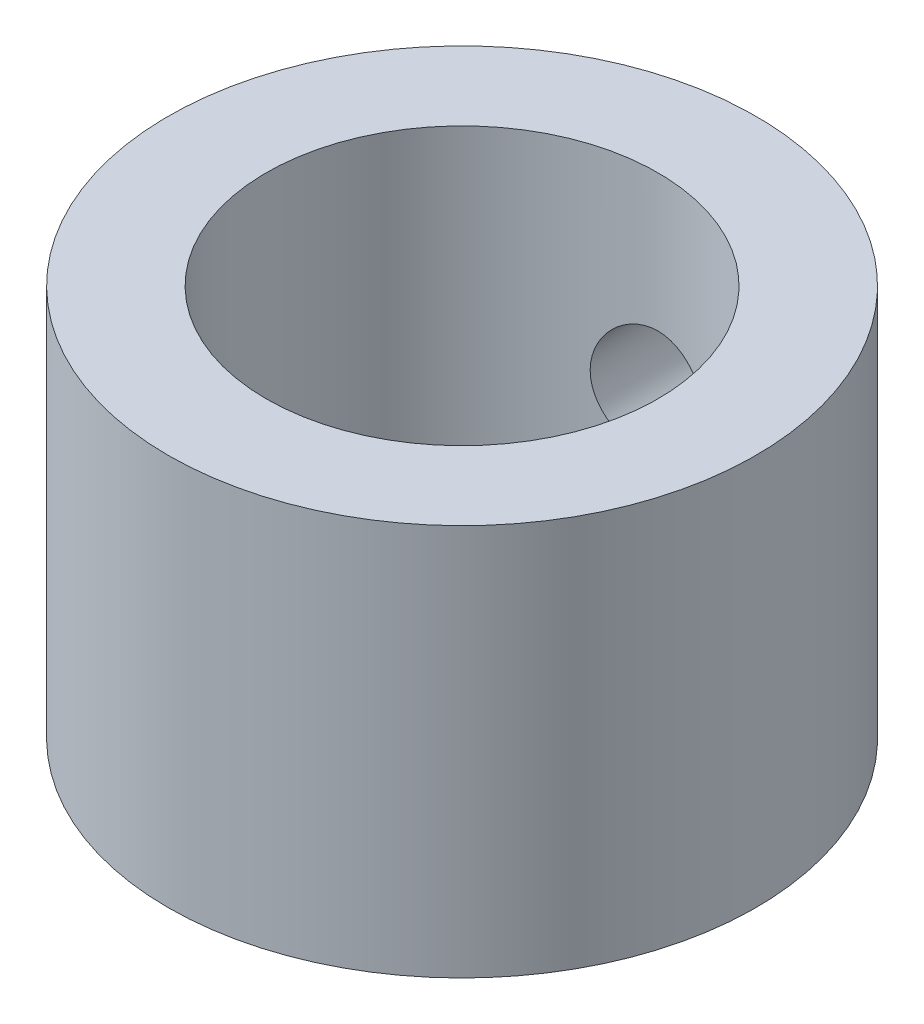
ISO-10303-21;
HEADER;
FILE_DESCRIPTION(('STEP AP214'),'2;1');
FILE_NAME('part.step','',(''),(''),'','','');
FILE_SCHEMA(('AUTOMOTIVE_DESIGN { 1 0 10303 214 1 1 1 1 }'));
ENDSEC;
DATA;
#1=APPLICATION_CONTEXT('core data for automotive mechanical design processes');
#2=APPLICATION_PROTOCOL_DEFINITION('international standard','automotive_design',2000,#1);
#3=PRODUCT_CONTEXT('',#1,'mechanical');
#4=PRODUCT('Part','Part','',(#3));
#5=PRODUCT_RELATED_PRODUCT_CATEGORY('part','',(#4));
#6=PRODUCT_DEFINITION_FORMATION('','',#4);
#7=PRODUCT_DEFINITION_CONTEXT('part definition',#1,'design');
#8=PRODUCT_DEFINITION('design','',#6,#7);
#9=PRODUCT_DEFINITION_SHAPE('','',#8);
#10=(LENGTH_UNIT() NAMED_UNIT(*) SI_UNIT(.MILLI.,.METRE.));
#11=(NAMED_UNIT(*) PLANE_ANGLE_UNIT() SI_UNIT($,.RADIAN.));
#12=(NAMED_UNIT(*) SI_UNIT($,.STERADIAN.) SOLID_ANGLE_UNIT());
#13=UNCERTAINTY_MEASURE_WITH_UNIT(LENGTH_MEASURE(1.E-05),#10,'distance_accuracy_value','');
#14=(GEOMETRIC_REPRESENTATION_CONTEXT(3) GLOBAL_UNCERTAINTY_ASSIGNED_CONTEXT((#13)) GLOBAL_UNIT_ASSIGNED_CONTEXT((#10,
#11,#12)) REPRESENTATION_CONTEXT('',''));
#15=CARTESIAN_POINT('',(0.,0.,0.));
#16=DIRECTION('',(0.,0.,1.));
#17=DIRECTION('',(1.,0.,0.));
#18=AXIS2_PLACEMENT_3D('',#15,#16,#17);
#19=CARTESIAN_POINT('',(0.,5.,0.));
#20=DIRECTION('',(0.,1.,0.));
#21=DIRECTION('',(0.,0.,1.));
#22=AXIS2_PLACEMENT_3D('',#19,#20,#21);
#23=PLANE('',#22);
#24=CARTESIAN_POINT('',(0.,5.,0.));
#25=DIRECTION('',(0.,1.,0.));
#26=DIRECTION('',(0.,0.,1.));
#27=AXIS2_PLACEMENT_3D('',#24,#25,#26);
#28=CIRCLE('',#27,7.5);
#29=CARTESIAN_POINT('',(0.,5.,7.5));
#30=VERTEX_POINT('',#29);
#31=EDGE_CURVE('E10',#30,#30,#28,.T.);
#32=ORIENTED_EDGE('',*,*,#31,.T.);
#33=EDGE_LOOP('',(#32));
#34=FACE_BOUND('',#33,.T.);
#35=CARTESIAN_POINT('',(0.,5.,0.));
#36=DIRECTION('',(0.,1.,0.));
#37=DIRECTION('',(0.,0.,1.));
#38=AXIS2_PLACEMENT_3D('',#35,#36,#37);
#39=CIRCLE('',#38,5.);
#40=CARTESIAN_POINT('',(0.,5.,5.));
#41=VERTEX_POINT('',#40);
#42=EDGE_CURVE('E55',#41,#41,#39,.T.);
#43=ORIENTED_EDGE('',*,*,#42,.F.);
#44=EDGE_LOOP('',(#43));
#45=FACE_BOUND('',#44,.T.);
#46=ADVANCED_FACE('F37',(#34,#45),#23,.T.);
#47=CARTESIAN_POINT('',(0.,-5.,0.));
#48=DIRECTION('',(0.,1.,0.));
#49=DIRECTION('',(0.,0.,1.));
#50=AXIS2_PLACEMENT_3D('',#47,#48,#49);
#51=PLANE('',#50);
#52=CARTESIAN_POINT('',(0.,-5.,0.));
#53=DIRECTION('',(0.,1.,0.));
#54=DIRECTION('',(0.,0.,1.));
#55=AXIS2_PLACEMENT_3D('',#52,#53,#54);
#56=CIRCLE('',#55,7.5);
#57=CARTESIAN_POINT('',(0.,-5.,7.5));
#58=VERTEX_POINT('',#57);
#59=EDGE_CURVE('E50',#58,#58,#56,.T.);
#60=ORIENTED_EDGE('',*,*,#59,.F.);
#61=EDGE_LOOP('',(#60));
#62=FACE_BOUND('',#61,.T.);
#63=CARTESIAN_POINT('',(0.,-5.,0.));
#64=DIRECTION('',(0.,1.,0.));
#65=DIRECTION('',(0.,0.,1.));
#66=AXIS2_PLACEMENT_3D('',#63,#64,#65);
#67=CIRCLE('',#66,5.);
#68=CARTESIAN_POINT('',(0.,-5.,5.));
#69=VERTEX_POINT('',#68);
#70=EDGE_CURVE('E57',#69,#69,#67,.T.);
#71=ORIENTED_EDGE('',*,*,#70,.T.);
#72=EDGE_LOOP('',(#71));
#73=FACE_BOUND('',#72,.T.);
#74=ADVANCED_FACE('F77',(#62,#73),#51,.F.);
#75=CARTESIAN_POINT('',(0.,5.,0.));
#76=DIRECTION('',(0.,-1.,0.));
#77=DIRECTION('',(0.,0.,-1.));
#78=AXIS2_PLACEMENT_3D('',#75,#76,#77);
#79=CYLINDRICAL_SURFACE('',#78,7.5);
#80=CARTESIAN_POINT('',(1.5,0.,-7.34846922834953));
#81=CARTESIAN_POINT('',(1.49999691881235,-0.0833465632357616,-7.34847088538349));
#82=CARTESIAN_POINT('',(1.49302975757707,-0.16673193499975,-7.34990262402618));
#83=CARTESIAN_POINT('',(1.46536842537441,-0.331143757714958,-7.35546646957746));
#84=CARTESIAN_POINT('',(1.44466327060578,-0.41216826695404,-7.35960073717297));
#85=CARTESIAN_POINT('',(1.39019367392958,-0.569455955031247,-7.37008310582665));
#86=CARTESIAN_POINT('',(1.35644222122892,-0.645723782298866,-7.37642900431582));
#87=CARTESIAN_POINT('',(1.27687366150577,-0.791512267045452,-7.39061699221019));
#88=CARTESIAN_POINT('',(1.23105722790173,-0.861033300806858,-7.398458998102));
#89=CARTESIAN_POINT('',(1.12796861348015,-0.992341505780786,-7.4148794954137));
#90=CARTESIAN_POINT('',(1.07055848386998,-1.05401938182596,-7.42346606755867));
#91=CARTESIAN_POINT('',(0.946210183531966,-1.16693630036847,-7.440337084539));
#92=CARTESIAN_POINT('',(0.879271345466976,-1.21817461112579,-7.44862150816248));
#93=CARTESIAN_POINT('',(0.737042033886383,-1.30918202644269,-7.46404194626342));
#94=CARTESIAN_POINT('',(0.661683851508316,-1.34884727072496,-7.47116732162326));
#95=CARTESIAN_POINT('',(0.505206225580907,-1.41491240557221,-7.48337605325447));
#96=CARTESIAN_POINT('',(0.424087322130829,-1.44131353785149,-7.48845960066179));
#97=CARTESIAN_POINT('',(0.259525159917741,-1.47976079042944,-7.49595481032628));
#98=CARTESIAN_POINT('',(0.176126608822221,-1.49199146635651,-7.4984007943219));
#99=CARTESIAN_POINT('',(0.00842785265630416,-1.50232642775747,-7.50046381775405));
#100=CARTESIAN_POINT('',(-0.0758722647477651,-1.50043207446873,-7.50008112979138));
#101=CARTESIAN_POINT('',(-0.241713001115383,-1.48271072967667,-7.49655652302773));
#102=CARTESIAN_POINT('',(-0.323275821447706,-1.46708253424823,-7.49345397548757));
#103=CARTESIAN_POINT('',(-0.482597439870452,-1.42265245131166,-7.48488265739113));
#104=CARTESIAN_POINT('',(-0.560356085620694,-1.39385003671219,-7.47941379216059));
#105=CARTESIAN_POINT('',(-0.710429194801331,-1.3237049397791,-7.46665944029938));
#106=CARTESIAN_POINT('',(-0.78270626120085,-1.28228437334267,-7.45936272262835));
#107=CARTESIAN_POINT('',(-0.919357568789634,-1.1881363841451,-7.44375704210678));
#108=CARTESIAN_POINT('',(-0.983730899287502,-1.13540766034423,-7.43544796282833));
#109=CARTESIAN_POINT('',(-1.10392714658019,-1.01904956683729,-7.41856446546689));
#110=CARTESIAN_POINT('',(-1.15958147486045,-0.955246219905615,-7.40998794686274));
#111=CARTESIAN_POINT('',(-1.25942773976521,-0.819125336323872,-7.39367357398141));
#112=CARTESIAN_POINT('',(-1.30361945959163,-0.746807638675206,-7.38593573556822));
#113=CARTESIAN_POINT('',(-1.37934422220282,-0.595468752267292,-7.37217071209385));
#114=CARTESIAN_POINT('',(-1.41084997166656,-0.516433548540507,-7.36614722345324));
#115=CARTESIAN_POINT('',(-1.46008551244137,-0.354043014414013,-7.35654714481909));
#116=CARTESIAN_POINT('',(-1.47781709918496,-0.270688248571374,-7.35297023592642));
#117=CARTESIAN_POINT('',(-1.49874900905408,-0.103552713001432,-7.34873218901742));
#118=CARTESIAN_POINT('',(-1.50219278834687,-0.0198036385344886,-7.34802220585731));
#119=CARTESIAN_POINT('',(-1.49510644246611,0.147072334799526,-7.34946728533281));
#120=CARTESIAN_POINT('',(-1.48457710968366,0.230199268678295,-7.35162218550582));
#121=CARTESIAN_POINT('',(-1.45005331211124,0.392652960438353,-7.35850848742372));
#122=CARTESIAN_POINT('',(-1.42618893125895,0.472008514553645,-7.36321498521745));
#123=CARTESIAN_POINT('',(-1.36581155296278,0.625594918543112,-7.37465234027497));
#124=CARTESIAN_POINT('',(-1.32929751355977,0.699825345653581,-7.38138336429404));
#125=CARTESIAN_POINT('',(-1.2441062133234,0.842119664925242,-7.39622108943059));
#126=CARTESIAN_POINT('',(-1.19527661697413,0.910090569451241,-7.40434457797355));
#127=CARTESIAN_POINT('',(-1.08704335831907,1.03696246800137,-7.42100585739955));
#128=CARTESIAN_POINT('',(-1.02763860771681,1.09586252737388,-7.42954369085727));
#129=CARTESIAN_POINT('',(-0.898848410246835,1.20384383877837,-7.44623018803823));
#130=CARTESIAN_POINT('',(-0.829323748394444,1.25276048197499,-7.45437086563026));
#131=CARTESIAN_POINT('',(-0.682901844952132,1.33821882224938,-7.4692069144293));
#132=CARTESIAN_POINT('',(-0.606004913150259,1.37476103901717,-7.47590234632816));
#133=CARTESIAN_POINT('',(-0.447454021236018,1.43419330761995,-7.487059410916));
#134=CARTESIAN_POINT('',(-0.365830010217116,1.45716077733938,-7.49153368713906));
#135=CARTESIAN_POINT('',(-0.199784182019868,1.48903687149577,-7.4977985390649));
#136=CARTESIAN_POINT('',(-0.11536270306682,1.49794718921352,-7.49958943799765));
#137=CARTESIAN_POINT('',(0.052309340855436,1.50139047144433,-7.50027810681181));
#138=CARTESIAN_POINT('',(0.135554718212254,1.49617092068432,-7.49922567824026));
#139=CARTESIAN_POINT('',(0.299956546973463,1.47204907417828,-7.49445065340477));
#140=CARTESIAN_POINT('',(0.381113024630538,1.45314695047789,-7.49072809071528));
#141=CARTESIAN_POINT('',(0.538879124617645,1.40230651186253,-7.481032475475));
#142=CARTESIAN_POINT('',(0.615498664860422,1.37039793280322,-7.47506455871866));
#143=CARTESIAN_POINT('',(0.762331830278929,1.29448163800365,-7.46152083185077));
#144=CARTESIAN_POINT('',(0.832544948651118,1.25047296614443,-7.45394489468828));
#145=CARTESIAN_POINT('',(0.965795835159536,1.15077091940688,-7.43786398736791));
#146=CARTESIAN_POINT('',(1.02869957417475,1.09490049541984,-7.4293460013317));
#147=CARTESIAN_POINT('',(1.14432392663527,0.973424639856348,-7.41241834355477));
#148=CARTESIAN_POINT('',(1.19704212480408,0.90781690579693,-7.40400869794476));
#149=CARTESIAN_POINT('',(1.29133832918279,0.767881024949694,-7.3881501412478));
#150=CARTESIAN_POINT('',(1.33279022195961,0.693466558259308,-7.38071255446371));
#151=CARTESIAN_POINT('',(1.40253607393175,0.538600840050601,-7.36777855777287));
#152=CARTESIAN_POINT('',(1.43084196896908,0.458155141953655,-7.36228038807748));
#153=CARTESIAN_POINT('',(1.4680037097813,0.314606316844753,-7.3549452169166));
#154=CARTESIAN_POINT('',(1.47998084778413,0.252321870731514,-7.35253177367824));
#155=CARTESIAN_POINT('',(1.49598002694097,0.126699068170847,-7.34929317692711));
#156=CARTESIAN_POINT('',(1.50000234234439,0.0633607481325584,-7.34846796865859));
#157=CARTESIAN_POINT('',(1.5,0.,-7.34846922834953));
#158=B_SPLINE_CURVE_WITH_KNOTS('',3,(#80,#81,#82,#83,#84,#85,#86,#87,#88,#89,#90,#91,#92,#93,
#94,#95,#96,#97,#98,#99,#100,#101,#102,#103,#104,#105,#106,#107,#108,#109,#110,#111,#112,#113,
#114,#115,#116,#117,#118,#119,#120,#121,#122,#123,#124,#125,#126,#127,#128,#129,#130,#131,#132,
#133,#134,#135,#136,#137,#138,#139,#140,#141,#142,#143,#144,#145,#146,#147,#148,#149,#150,#151,
#152,#153,#154,#155,#156,#157),.UNSPECIFIED.,.T.,.F.,(4,2,2,2,2,2,2,2,2,2,2,2,2,2,2,2,2,2,2,2,2,
2,2,2,2,2,2,2,2,2,2,2,2,2,2,2,2,2,4),(0.,0.249807695804142,0.499815358926445,0.749574746910879,
0.999320197289796,1.25223378822655,1.50516510053133,1.76030100656175,2.0154130236984,
2.26716373324621,2.51889018174372,2.76703184450306,3.01518343610625,3.26489886333455,
3.51464303655099,3.76874020143725,4.02284217184081,4.27748794759165,4.53210052524037,
4.7823563670689,5.03259801792632,5.28044012674978,5.52830265531598,5.77939589661782,
6.03051499305313,6.28548902600176,6.54045234945157,6.79394720367975,7.04741152037442,
7.29646526122029,7.54551587050135,7.79400025613178,8.04250428202026,8.29501728038395,
8.54759008334672,8.80288347868562,9.05794462633399,9.24785705455344,9.43776293526322),.UNSPECIFIED.);
#159=CARTESIAN_POINT('',(1.5,0.,-7.34846922834953));
#160=VERTEX_POINT('',#159);
#161=EDGE_CURVE('E62',#160,#160,#158,.T.);
#162=ORIENTED_EDGE('',*,*,#161,.F.);
#163=EDGE_LOOP('',(#162));
#164=FACE_BOUND('',#163,.T.);
#165=ORIENTED_EDGE('',*,*,#31,.F.);
#166=EDGE_LOOP('',(#165));
#167=FACE_BOUND('',#166,.T.);
#168=ORIENTED_EDGE('',*,*,#59,.T.);
#169=EDGE_LOOP('',(#168));
#170=FACE_BOUND('',#169,.T.);
#171=ADVANCED_FACE('F39',(#164,#167,#170),#79,.T.);
#172=CARTESIAN_POINT('',(0.,5.,0.));
#173=DIRECTION('',(0.,-1.,0.));
#174=DIRECTION('',(0.,0.,-1.));
#175=AXIS2_PLACEMENT_3D('',#172,#173,#174);
#176=CYLINDRICAL_SURFACE('',#175,5.);
#177=CARTESIAN_POINT('',(0.,1.5,-5.));
#178=CARTESIAN_POINT('',(-0.0822886127532999,1.49999900251511,-4.9999992925055));
#179=CARTESIAN_POINT('',(-0.164587318351529,1.49320613637603,-4.99794915693953));
#180=CARTESIAN_POINT('',(-0.326788125304881,1.4662786457779,-4.98997105593691));
#181=CARTESIAN_POINT('',(-0.40668950441142,1.44614004197666,-4.98404193389692));
#182=CARTESIAN_POINT('',(-0.561732707754526,1.39325398308974,-4.96895552501836));
#183=CARTESIAN_POINT('',(-0.636881364395373,1.36052513038106,-4.95980300250425));
#184=CARTESIAN_POINT('',(-0.780624181053131,1.28346390694416,-4.93922109237645));
#185=CARTESIAN_POINT('',(-0.849217467469669,1.23912999260458,-4.92779140192067));
#186=CARTESIAN_POINT('',(-0.979871797183745,1.13877599252733,-4.90350737192774));
#187=CARTESIAN_POINT('',(-1.04171807124434,1.08248337411409,-4.89062383657036));
#188=CARTESIAN_POINT('',(-1.15524920923324,0.960390770089816,-4.86505834210442));
#189=CARTESIAN_POINT('',(-1.20693236327441,0.89458918787504,-4.85237641724501));
#190=CARTESIAN_POINT('',(-1.29980037723708,0.753529246962388,-4.82834113993772));
#191=CARTESIAN_POINT('',(-1.34072309022213,0.678091539009262,-4.81702406663875));
#192=CARTESIAN_POINT('',(-1.4092139477476,0.521010745769707,-4.79743620394031));
#193=CARTESIAN_POINT('',(-1.43678529919973,0.439369156072024,-4.78916468313311));
#194=CARTESIAN_POINT('',(-1.47701633682652,0.27460973386954,-4.77690870838434));
#195=CARTESIAN_POINT('',(-1.49007196234677,0.191597256136057,-4.77281069324533));
#196=CARTESIAN_POINT('',(-1.50213730614672,0.0244668437832343,-4.76902789749767));
#197=CARTESIAN_POINT('',(-1.50115042761078,-0.0596508180590877,-4.76934204760571));
#198=CARTESIAN_POINT('',(-1.48546977199812,-0.223383908608484,-4.77424744067778));
#199=CARTESIAN_POINT('',(-1.47127205262685,-0.303052250362239,-4.7786838859914));
#200=CARTESIAN_POINT('',(-1.43037420427056,-0.458819786273461,-4.79108356228624));
#201=CARTESIAN_POINT('',(-1.40367284141641,-0.534918627374333,-4.7990471413235));
#202=CARTESIAN_POINT('',(-1.33816026653682,-0.68260034966074,-4.81772733074973));
#203=CARTESIAN_POINT('',(-1.29918816934642,-0.754107083955263,-4.82848016115952));
#204=CARTESIAN_POINT('',(-1.21035222588683,-0.889732022010193,-4.85150987000064));
#205=CARTESIAN_POINT('',(-1.16048574002588,-0.953848429413778,-4.86378711746991));
#206=CARTESIAN_POINT('',(-1.04881290765546,-1.07568619076202,-4.88911011297937));
#207=CARTESIAN_POINT('',(-0.986594907466972,-1.13302866402967,-4.90216654310498));
#208=CARTESIAN_POINT('',(-0.853263259313967,-1.23655398406425,-4.92712244063258));
#209=CARTESIAN_POINT('',(-0.782149051860888,-1.28273612841443,-4.9390218351841));
#210=CARTESIAN_POINT('',(-0.632355038342803,-1.36285992246473,-4.9604316006947));
#211=CARTESIAN_POINT('',(-0.55362774974795,-1.39671751624986,-4.96992543668314));
#212=CARTESIAN_POINT('',(-0.391245415603519,-1.45059959009963,-4.98533521832222));
#213=CARTESIAN_POINT('',(-0.307591751589581,-1.47062792853249,-4.99125216186999));
#214=CARTESIAN_POINT('',(-0.140952242668331,-1.49565217789939,-4.99868364643538));
#215=CARTESIAN_POINT('',(-0.0580500976011867,-1.50116158580161,-5.0003485041779));
#216=CARTESIAN_POINT('',(0.107499605823383,-1.49843084428792,-4.99952923241759));
#217=CARTESIAN_POINT('',(0.190147196690781,-1.49019253034856,-4.99704565677756));
#218=CARTESIAN_POINT('',(0.350903605309697,-1.4606153888885,-4.98830696987163));
#219=CARTESIAN_POINT('',(0.429072772614169,-1.43957661241913,-4.98213829799417));
#220=CARTESIAN_POINT('',(0.580754638954522,-1.3853567672218,-4.96674347841532));
#221=CARTESIAN_POINT('',(0.654266777025583,-1.35217423896214,-4.95751696321085));
#222=CARTESIAN_POINT('',(0.796437189461052,-1.27374683451887,-4.93669654351325));
#223=CARTESIAN_POINT('',(0.864943826199669,-1.22824065905203,-4.92505280829675));
#224=CARTESIAN_POINT('',(0.993523307980147,-1.12677524594719,-4.90073468764317));
#225=CARTESIAN_POINT('',(1.05359403235593,-1.07081338811233,-4.8880600443108));
#226=CARTESIAN_POINT('',(1.16585744551027,-0.947612691630655,-4.86253171869138));
#227=CARTESIAN_POINT('',(1.21768481231504,-0.880038124228263,-4.84968825033268));
#228=CARTESIAN_POINT('',(1.30928995072154,-0.736872060986467,-4.82576515238463));
#229=CARTESIAN_POINT('',(1.34906803829472,-0.661280775441786,-4.81468547654651));
#230=CARTESIAN_POINT('',(1.41517347127168,-0.504467508745312,-4.79567189615055));
#231=CARTESIAN_POINT('',(1.4415634693705,-0.423273813463409,-4.78772337843827));
#232=CARTESIAN_POINT('',(1.48021730815114,-0.257312031068522,-4.77591594362794));
#233=CARTESIAN_POINT('',(1.49248598978779,-0.172545179212331,-4.772055625083));
#234=CARTESIAN_POINT('',(1.50221984485059,-0.00563848162377246,-4.76899972496087));
#235=CARTESIAN_POINT('',(1.5002805530849,0.0764636510175857,-4.76961647442754));
#236=CARTESIAN_POINT('',(1.48307505444813,0.2391141033728,-4.77499401288294));
#237=CARTESIAN_POINT('',(1.46780938124716,0.319662485176353,-4.77975463592551));
#238=CARTESIAN_POINT('',(1.42476888804136,0.475945399142852,-4.79275763670385));
#239=CARTESIAN_POINT('',(1.39715175507068,0.551727287361693,-4.80095604545965));
#240=CARTESIAN_POINT('',(1.33031507121129,0.697642438817723,-4.81990278909136));
#241=CARTESIAN_POINT('',(1.29109329962876,0.767774617640757,-4.83065161194312));
#242=CARTESIAN_POINT('',(1.20048763805072,0.903163116527113,-4.85397676425833));
#243=CARTESIAN_POINT('',(1.14871276092994,0.968148761260411,-4.86660540163797));
#244=CARTESIAN_POINT('',(1.03517434629782,1.08870249830786,-4.89201320450026));
#245=CARTESIAN_POINT('',(0.973408217134502,1.14426813946776,-4.90479240823905));
#246=CARTESIAN_POINT('',(0.839465762183249,1.24602341229503,-4.92950936570649));
#247=CARTESIAN_POINT('',(0.767037885790608,1.29189144685549,-4.94141159765674));
#248=CARTESIAN_POINT('',(0.61514137398353,1.37073516990402,-4.96260680455813));
#249=CARTESIAN_POINT('',(0.535676052998955,1.40371688827451,-4.97190099931066));
#250=CARTESIAN_POINT('',(0.380757712655281,1.45289527565275,-4.98602174969301));
#251=CARTESIAN_POINT('',(0.305786961954234,1.47051167288325,-4.99122027381067));
#252=CARTESIAN_POINT('',(0.153880195230779,1.49406352524158,-4.99820944494492));
#253=CARTESIAN_POINT('',(0.0769445098581396,1.50000093270482,-5.0000006615474));
#254=CARTESIAN_POINT('',(0.,1.5,-5.));
#255=B_SPLINE_CURVE_WITH_KNOTS('',3,(#177,#178,#179,#180,#181,#182,#183,#184,#185,#186,#187,
#188,#189,#190,#191,#192,#193,#194,#195,#196,#197,#198,#199,#200,#201,#202,#203,#204,#205,#206,
#207,#208,#209,#210,#211,#212,#213,#214,#215,#216,#217,#218,#219,#220,#221,#222,#223,#224,#225,
#226,#227,#228,#229,#230,#231,#232,#233,#234,#235,#236,#237,#238,#239,#240,#241,#242,#243,#244,
#245,#246,#247,#248,#249,#250,#251,#252,#253,#254),.UNSPECIFIED.,.T.,.F.,(4,2,2,2,2,2,2,2,2,2,2,
2,2,2,2,2,2,2,2,2,2,2,2,2,2,2,2,2,2,2,2,2,2,2,2,2,2,2,4),(0.,0.246583203612611,
0.493239964845999,0.739533676300874,0.985860164412702,1.23855602948191,1.49129437288633,
1.74971481004109,2.00807314543224,2.25919689356599,2.51025978319089,2.75226016697676,
2.99428443658001,3.2396242644712,3.48502360158555,3.74067104048167,3.99633456531072,
4.25371046881689,4.51101453528808,4.75908809438545,5.00712853550327,5.24956746682327,
5.49203554593729,5.74011305702908,5.98825282000191,6.24540400322819,6.5025484425268,
6.75847814951252,7.01432009460283,7.25950155466943,7.504673196616,7.74680040402721,
7.98897397553107,8.23996925679931,8.49102974897502,8.74942996156671,9.00770911595235,
9.23831691930459,9.46888616948874),.UNSPECIFIED.);
#256=CARTESIAN_POINT('',(0.,1.5,-5.));
#257=VERTEX_POINT('',#256);
#258=EDGE_CURVE('E41',#257,#257,#255,.T.);
#259=ORIENTED_EDGE('',*,*,#258,.F.);
#260=EDGE_LOOP('',(#259));
#261=FACE_BOUND('',#260,.T.);
#262=ORIENTED_EDGE('',*,*,#42,.T.);
#263=EDGE_LOOP('',(#262));
#264=FACE_BOUND('',#263,.T.);
#265=ORIENTED_EDGE('',*,*,#70,.F.);
#266=EDGE_LOOP('',(#265));
#267=FACE_BOUND('',#266,.T.);
#268=ADVANCED_FACE('F71',(#261,#264,#267),#176,.F.);
#269=CARTESIAN_POINT('',(0.,0.,-7.501));
#270=DIRECTION('',(0.,0.,1.));
#271=DIRECTION('',(1.,0.,0.));
#272=AXIS2_PLACEMENT_3D('',#269,#270,#271);
#273=CYLINDRICAL_SURFACE('',#272,1.5);
#274=ORIENTED_EDGE('',*,*,#258,.T.);
#275=EDGE_LOOP('',(#274));
#276=FACE_BOUND('',#275,.T.);
#277=ORIENTED_EDGE('',*,*,#161,.T.);
#278=EDGE_LOOP('',(#277));
#279=FACE_BOUND('',#278,.T.);
#280=ADVANCED_FACE('F68',(#276,#279),#273,.F.);
#281=CLOSED_SHELL('',(#46,#74,#171,#268,#280));
#282=MANIFOLD_SOLID_BREP('B2',#281);
#283=ADVANCED_BREP_SHAPE_REPRESENTATION('',(#18,#282),#14);
#284=SHAPE_DEFINITION_REPRESENTATION(#9,#283);
ENDSEC;
END-ISO-10303-21;
